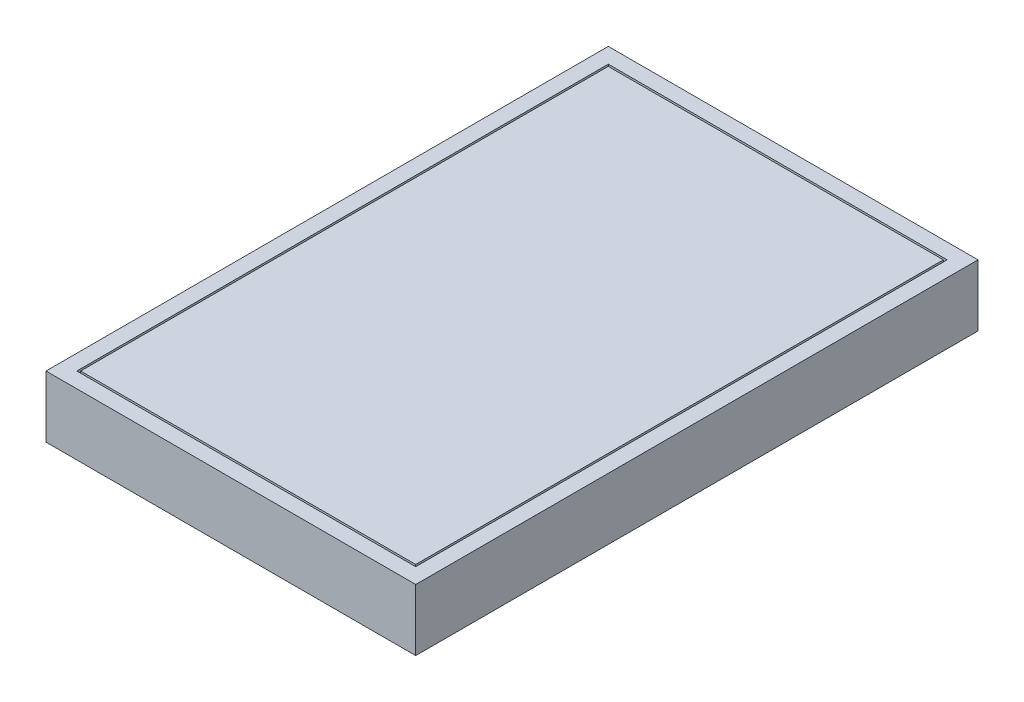
ISO-10303-21;
HEADER;
FILE_DESCRIPTION(('STEP AP214'),'2;1');
FILE_NAME('part.step','',(''),(''),'','','');
FILE_SCHEMA(('AUTOMOTIVE_DESIGN { 1 0 10303 214 1 1 1 1 }'));
ENDSEC;
DATA;
#1=APPLICATION_CONTEXT('core data for automotive mechanical design processes');
#2=APPLICATION_PROTOCOL_DEFINITION('international standard','automotive_design',2000,#1);
#3=PRODUCT_CONTEXT('',#1,'mechanical');
#4=PRODUCT('Part','Part','',(#3));
#5=PRODUCT_RELATED_PRODUCT_CATEGORY('part','',(#4));
#6=PRODUCT_DEFINITION_FORMATION('','',#4);
#7=PRODUCT_DEFINITION_CONTEXT('part definition',#1,'design');
#8=PRODUCT_DEFINITION('design','',#6,#7);
#9=PRODUCT_DEFINITION_SHAPE('','',#8);
#10=(LENGTH_UNIT() NAMED_UNIT(*) SI_UNIT(.MILLI.,.METRE.));
#11=(NAMED_UNIT(*) PLANE_ANGLE_UNIT() SI_UNIT($,.RADIAN.));
#12=(NAMED_UNIT(*) SI_UNIT($,.STERADIAN.) SOLID_ANGLE_UNIT());
#13=UNCERTAINTY_MEASURE_WITH_UNIT(LENGTH_MEASURE(1.E-05),#10,'distance_accuracy_value','');
#14=(GEOMETRIC_REPRESENTATION_CONTEXT(3) GLOBAL_UNCERTAINTY_ASSIGNED_CONTEXT((#13)) GLOBAL_UNIT_ASSIGNED_CONTEXT((#10,
#11,#12)) REPRESENTATION_CONTEXT('',''));
#15=CARTESIAN_POINT('',(0.,0.,0.));
#16=DIRECTION('',(0.,0.,1.));
#17=DIRECTION('',(1.,0.,0.));
#18=AXIS2_PLACEMENT_3D('',#15,#16,#17);
#19=CARTESIAN_POINT('',(0.,8.99999999999999,0.));
#20=DIRECTION('',(0.,1.,0.));
#21=DIRECTION('',(0.,0.,1.));
#22=AXIS2_PLACEMENT_3D('',#19,#20,#21);
#23=PLANE('',#22);
#24=DIRECTION('',(0.,0.,1.));
#25=VECTOR('',#24,1.);
#26=CARTESIAN_POINT('',(-220.,8.99999999999999,20.));
#27=LINE('',#26,#25);
#28=CARTESIAN_POINT('',(-220.,8.99999999999999,20.));
#29=VERTEX_POINT('',#28);
#30=CARTESIAN_POINT('',(-220.,8.99999999999999,710.));
#31=VERTEX_POINT('',#30);
#32=EDGE_CURVE('E155',#29,#31,#27,.T.);
#33=ORIENTED_EDGE('',*,*,#32,.T.);
#34=DIRECTION('',(1.,0.,0.));
#35=VECTOR('',#34,1.);
#36=CARTESIAN_POINT('',(-220.,8.99999999999999,710.));
#37=LINE('',#36,#35);
#38=CARTESIAN_POINT('',(220.,8.99999999999999,710.));
#39=VERTEX_POINT('',#38);
#40=EDGE_CURVE('E158',#31,#39,#37,.T.);
#41=ORIENTED_EDGE('',*,*,#40,.T.);
#42=DIRECTION('',(0.,0.,-1.));
#43=VECTOR('',#42,1.);
#44=CARTESIAN_POINT('',(220.,8.99999999999999,710.));
#45=LINE('',#44,#43);
#46=CARTESIAN_POINT('',(220.,8.99999999999999,20.));
#47=VERTEX_POINT('',#46);
#48=EDGE_CURVE('E162',#39,#47,#45,.T.);
#49=ORIENTED_EDGE('',*,*,#48,.T.);
#50=DIRECTION('',(-1.,0.,0.));
#51=VECTOR('',#50,1.);
#52=CARTESIAN_POINT('',(220.,8.99999999999999,20.));
#53=LINE('',#52,#51);
#54=EDGE_CURVE('E165',#47,#29,#53,.T.);
#55=ORIENTED_EDGE('',*,*,#54,.T.);
#56=EDGE_LOOP('',(#33,#41,#49,#55));
#57=FACE_BOUND('',#56,.T.);
#58=DIRECTION('',(0.,0.,-1.));
#59=VECTOR('',#58,1.);
#60=CARTESIAN_POINT('',(217.5,8.99999999999999,22.5));
#61=LINE('',#60,#59);
#62=CARTESIAN_POINT('',(217.5,8.99999999999999,707.5));
#63=VERTEX_POINT('',#62);
#64=CARTESIAN_POINT('',(217.5,8.99999999999999,22.5));
#65=VERTEX_POINT('',#64);
#66=EDGE_CURVE('E372',#63,#65,#61,.T.);
#67=ORIENTED_EDGE('',*,*,#66,.F.);
#68=DIRECTION('',(1.,0.,0.));
#69=VECTOR('',#68,1.);
#70=CARTESIAN_POINT('',(217.5,8.99999999999999,707.5));
#71=LINE('',#70,#69);
#72=CARTESIAN_POINT('',(-217.5,8.99999999999999,707.5));
#73=VERTEX_POINT('',#72);
#74=EDGE_CURVE('E147',#73,#63,#71,.T.);
#75=ORIENTED_EDGE('',*,*,#74,.F.);
#76=DIRECTION('',(0.,0.,1.));
#77=VECTOR('',#76,1.);
#78=CARTESIAN_POINT('',(-217.5,8.99999999999999,707.5));
#79=LINE('',#78,#77);
#80=CARTESIAN_POINT('',(-217.5,8.99999999999999,22.5));
#81=VERTEX_POINT('',#80);
#82=EDGE_CURVE('E143',#81,#73,#79,.T.);
#83=ORIENTED_EDGE('',*,*,#82,.F.);
#84=DIRECTION('',(-1.,0.,0.));
#85=VECTOR('',#84,1.);
#86=CARTESIAN_POINT('',(-217.5,8.99999999999999,22.5));
#87=LINE('',#86,#85);
#88=EDGE_CURVE('E369',#65,#81,#87,.T.);
#89=ORIENTED_EDGE('',*,*,#88,.F.);
#90=EDGE_LOOP('',(#67,#75,#83,#89));
#91=FACE_BOUND('',#90,.T.);
#92=ADVANCED_FACE('F34',(#57,#91),#23,.T.);
#93=CARTESIAN_POINT('',(-240.,20.,730.));
#94=DIRECTION('',(-1.,0.,0.));
#95=DIRECTION('',(0.,0.,1.));
#96=AXIS2_PLACEMENT_3D('',#93,#94,#95);
#97=PLANE('',#96);
#98=DIRECTION('',(0.,0.,-1.));
#99=VECTOR('',#98,1.);
#100=CARTESIAN_POINT('',(-240.,-60.,730.));
#101=LINE('',#100,#99);
#102=CARTESIAN_POINT('',(-240.,-60.,730.));
#103=VERTEX_POINT('',#102);
#104=CARTESIAN_POINT('',(-240.,-60.,0.));
#105=VERTEX_POINT('',#104);
#106=EDGE_CURVE('E178',#103,#105,#101,.T.);
#107=ORIENTED_EDGE('',*,*,#106,.F.);
#108=DIRECTION('',(0.,-1.,0.));
#109=VECTOR('',#108,1.);
#110=CARTESIAN_POINT('',(-240.,20.,730.));
#111=LINE('',#110,#109);
#112=CARTESIAN_POINT('',(-240.,20.,730.));
#113=VERTEX_POINT('',#112);
#114=EDGE_CURVE('E11',#113,#103,#111,.T.);
#115=ORIENTED_EDGE('',*,*,#114,.F.);
#116=DIRECTION('',(0.,0.,-1.));
#117=VECTOR('',#116,1.);
#118=CARTESIAN_POINT('',(-240.,20.,730.));
#119=LINE('',#118,#117);
#120=CARTESIAN_POINT('',(-240.,20.,0.));
#121=VERTEX_POINT('',#120);
#122=EDGE_CURVE('E184',#113,#121,#119,.T.);
#123=ORIENTED_EDGE('',*,*,#122,.T.);
#124=DIRECTION('',(0.,-1.,0.));
#125=VECTOR('',#124,1.);
#126=CARTESIAN_POINT('',(-240.,20.,0.));
#127=LINE('',#126,#125);
#128=EDGE_CURVE('E38',#121,#105,#127,.T.);
#129=ORIENTED_EDGE('',*,*,#128,.T.);
#130=EDGE_LOOP('',(#107,#115,#123,#129));
#131=FACE_BOUND('',#130,.T.);
#132=ADVANCED_FACE('F36',(#131),#97,.T.);
#133=CARTESIAN_POINT('',(240.,20.,730.));
#134=DIRECTION('',(0.,0.,1.));
#135=DIRECTION('',(1.,0.,0.));
#136=AXIS2_PLACEMENT_3D('',#133,#134,#135);
#137=PLANE('',#136);
#138=DIRECTION('',(-1.,0.,0.));
#139=VECTOR('',#138,1.);
#140=CARTESIAN_POINT('',(240.,-60.,730.));
#141=LINE('',#140,#139);
#142=CARTESIAN_POINT('',(240.,-60.,730.));
#143=VERTEX_POINT('',#142);
#144=EDGE_CURVE('E188',#143,#103,#141,.T.);
#145=ORIENTED_EDGE('',*,*,#144,.F.);
#146=DIRECTION('',(0.,-1.,0.));
#147=VECTOR('',#146,1.);
#148=CARTESIAN_POINT('',(240.,20.,730.));
#149=LINE('',#148,#147);
#150=CARTESIAN_POINT('',(240.,20.,730.));
#151=VERTEX_POINT('',#150);
#152=EDGE_CURVE('E43',#151,#143,#149,.T.);
#153=ORIENTED_EDGE('',*,*,#152,.F.);
#154=DIRECTION('',(-1.,0.,0.));
#155=VECTOR('',#154,1.);
#156=CARTESIAN_POINT('',(240.,20.,730.));
#157=LINE('',#156,#155);
#158=EDGE_CURVE('E194',#151,#113,#157,.T.);
#159=ORIENTED_EDGE('',*,*,#158,.T.);
#160=ORIENTED_EDGE('',*,*,#114,.T.);
#161=EDGE_LOOP('',(#145,#153,#159,#160));
#162=FACE_BOUND('',#161,.T.);
#163=ADVANCED_FACE('F220',(#162),#137,.T.);
#164=CARTESIAN_POINT('',(240.,20.,0.));
#165=DIRECTION('',(1.,0.,0.));
#166=DIRECTION('',(0.,0.,-1.));
#167=AXIS2_PLACEMENT_3D('',#164,#165,#166);
#168=PLANE('',#167);
#169=DIRECTION('',(0.,0.,1.));
#170=VECTOR('',#169,1.);
#171=CARTESIAN_POINT('',(240.,-60.,0.));
#172=LINE('',#171,#170);
#173=CARTESIAN_POINT('',(240.,-60.,0.));
#174=VERTEX_POINT('',#173);
#175=EDGE_CURVE('E202',#174,#143,#172,.T.);
#176=ORIENTED_EDGE('',*,*,#175,.F.);
#177=DIRECTION('',(0.,-1.,0.));
#178=VECTOR('',#177,1.);
#179=CARTESIAN_POINT('',(240.,20.,0.));
#180=LINE('',#179,#178);
#181=CARTESIAN_POINT('',(240.,20.,0.));
#182=VERTEX_POINT('',#181);
#183=EDGE_CURVE('E207',#182,#174,#180,.T.);
#184=ORIENTED_EDGE('',*,*,#183,.F.);
#185=DIRECTION('',(0.,0.,1.));
#186=VECTOR('',#185,1.);
#187=CARTESIAN_POINT('',(240.,20.,0.));
#188=LINE('',#187,#186);
#189=EDGE_CURVE('E191',#182,#151,#188,.T.);
#190=ORIENTED_EDGE('',*,*,#189,.T.);
#191=ORIENTED_EDGE('',*,*,#152,.T.);
#192=EDGE_LOOP('',(#176,#184,#190,#191));
#193=FACE_BOUND('',#192,.T.);
#194=ADVANCED_FACE('F226',(#193),#168,.T.);
#195=CARTESIAN_POINT('',(-240.,20.,0.));
#196=DIRECTION('',(0.,0.,-1.));
#197=DIRECTION('',(-1.,0.,0.));
#198=AXIS2_PLACEMENT_3D('',#195,#196,#197);
#199=PLANE('',#198);
#200=DIRECTION('',(1.,0.,0.));
#201=VECTOR('',#200,1.);
#202=CARTESIAN_POINT('',(-240.,-60.,0.));
#203=LINE('',#202,#201);
#204=EDGE_CURVE('E199',#105,#174,#203,.T.);
#205=ORIENTED_EDGE('',*,*,#204,.F.);
#206=ORIENTED_EDGE('',*,*,#128,.F.);
#207=DIRECTION('',(1.,0.,0.));
#208=VECTOR('',#207,1.);
#209=CARTESIAN_POINT('',(-240.,20.,0.));
#210=LINE('',#209,#208);
#211=EDGE_CURVE('E187',#121,#182,#210,.T.);
#212=ORIENTED_EDGE('',*,*,#211,.T.);
#213=ORIENTED_EDGE('',*,*,#183,.T.);
#214=EDGE_LOOP('',(#205,#206,#212,#213));
#215=FACE_BOUND('',#214,.T.);
#216=ADVANCED_FACE('F215',(#215),#199,.T.);
#217=CARTESIAN_POINT('',(0.,20.,0.));
#218=DIRECTION('',(0.,-1.,0.));
#219=DIRECTION('',(0.,0.,-1.));
#220=AXIS2_PLACEMENT_3D('',#217,#218,#219);
#221=PLANE('',#220);
#222=DIRECTION('',(1.,0.,0.));
#223=VECTOR('',#222,1.);
#224=CARTESIAN_POINT('',(-220.,20.,710.));
#225=LINE('',#224,#223);
#226=CARTESIAN_POINT('',(-220.,20.,710.));
#227=VERTEX_POINT('',#226);
#228=CARTESIAN_POINT('',(220.,20.,710.));
#229=VERTEX_POINT('',#228);
#230=EDGE_CURVE('E150',#227,#229,#225,.T.);
#231=ORIENTED_EDGE('',*,*,#230,.F.);
#232=DIRECTION('',(0.,0.,1.));
#233=VECTOR('',#232,1.);
#234=CARTESIAN_POINT('',(-220.,20.,20.));
#235=LINE('',#234,#233);
#236=CARTESIAN_POINT('',(-220.,20.,20.));
#237=VERTEX_POINT('',#236);
#238=EDGE_CURVE('E59',#237,#227,#235,.T.);
#239=ORIENTED_EDGE('',*,*,#238,.F.);
#240=DIRECTION('',(-1.,0.,0.));
#241=VECTOR('',#240,1.);
#242=CARTESIAN_POINT('',(220.,20.,20.));
#243=LINE('',#242,#241);
#244=CARTESIAN_POINT('',(220.,20.,20.));
#245=VERTEX_POINT('',#244);
#246=EDGE_CURVE('E159',#245,#237,#243,.T.);
#247=ORIENTED_EDGE('',*,*,#246,.F.);
#248=DIRECTION('',(0.,0.,-1.));
#249=VECTOR('',#248,1.);
#250=CARTESIAN_POINT('',(220.,20.,710.));
#251=LINE('',#250,#249);
#252=EDGE_CURVE('E171',#229,#245,#251,.T.);
#253=ORIENTED_EDGE('',*,*,#252,.F.);
#254=EDGE_LOOP('',(#231,#239,#247,#253));
#255=FACE_BOUND('',#254,.T.);
#256=ORIENTED_EDGE('',*,*,#122,.F.);
#257=ORIENTED_EDGE('',*,*,#158,.F.);
#258=ORIENTED_EDGE('',*,*,#189,.F.);
#259=ORIENTED_EDGE('',*,*,#211,.F.);
#260=EDGE_LOOP('',(#256,#257,#258,#259));
#261=FACE_BOUND('',#260,.T.);
#262=ADVANCED_FACE('F223',(#255,#261),#221,.F.);
#263=CARTESIAN_POINT('',(0.,-60.,0.));
#264=DIRECTION('',(0.,-1.,0.));
#265=DIRECTION('',(0.,0.,-1.));
#266=AXIS2_PLACEMENT_3D('',#263,#264,#265);
#267=PLANE('',#266);
#268=ORIENTED_EDGE('',*,*,#106,.T.);
#269=ORIENTED_EDGE('',*,*,#204,.T.);
#270=ORIENTED_EDGE('',*,*,#175,.T.);
#271=ORIENTED_EDGE('',*,*,#144,.T.);
#272=EDGE_LOOP('',(#268,#269,#270,#271));
#273=FACE_BOUND('',#272,.T.);
#274=ADVANCED_FACE('F217',(#273),#267,.T.);
#275=CARTESIAN_POINT('',(-220.,8.99999999999999,20.));
#276=DIRECTION('',(-1.,0.,0.));
#277=DIRECTION('',(0.,0.,1.));
#278=AXIS2_PLACEMENT_3D('',#275,#276,#277);
#279=PLANE('',#278);
#280=ORIENTED_EDGE('',*,*,#238,.T.);
#281=DIRECTION('',(0.,1.,0.));
#282=VECTOR('',#281,1.);
#283=CARTESIAN_POINT('',(-220.,8.99999999999999,710.));
#284=LINE('',#283,#282);
#285=EDGE_CURVE('E167',#31,#227,#284,.T.);
#286=ORIENTED_EDGE('',*,*,#285,.F.);
#287=ORIENTED_EDGE('',*,*,#32,.F.);
#288=DIRECTION('',(0.,1.,0.));
#289=VECTOR('',#288,1.);
#290=CARTESIAN_POINT('',(-220.,8.99999999999999,20.));
#291=LINE('',#290,#289);
#292=EDGE_CURVE('E176',#29,#237,#291,.T.);
#293=ORIENTED_EDGE('',*,*,#292,.T.);
#294=EDGE_LOOP('',(#280,#286,#287,#293));
#295=FACE_BOUND('',#294,.T.);
#296=ADVANCED_FACE('F248',(#295),#279,.F.);
#297=CARTESIAN_POINT('',(220.,8.99999999999999,20.));
#298=DIRECTION('',(0.,0.,-1.));
#299=DIRECTION('',(-1.,0.,0.));
#300=AXIS2_PLACEMENT_3D('',#297,#298,#299);
#301=PLANE('',#300);
#302=ORIENTED_EDGE('',*,*,#246,.T.);
#303=ORIENTED_EDGE('',*,*,#292,.F.);
#304=ORIENTED_EDGE('',*,*,#54,.F.);
#305=DIRECTION('',(0.,1.,0.));
#306=VECTOR('',#305,1.);
#307=CARTESIAN_POINT('',(220.,8.99999999999999,20.));
#308=LINE('',#307,#306);
#309=EDGE_CURVE('E179',#47,#245,#308,.T.);
#310=ORIENTED_EDGE('',*,*,#309,.T.);
#311=EDGE_LOOP('',(#302,#303,#304,#310));
#312=FACE_BOUND('',#311,.T.);
#313=ADVANCED_FACE('F244',(#312),#301,.F.);
#314=CARTESIAN_POINT('',(220.,8.99999999999999,710.));
#315=DIRECTION('',(1.,0.,0.));
#316=DIRECTION('',(0.,0.,-1.));
#317=AXIS2_PLACEMENT_3D('',#314,#315,#316);
#318=PLANE('',#317);
#319=ORIENTED_EDGE('',*,*,#252,.T.);
#320=ORIENTED_EDGE('',*,*,#309,.F.);
#321=ORIENTED_EDGE('',*,*,#48,.F.);
#322=DIRECTION('',(0.,1.,0.));
#323=VECTOR('',#322,1.);
#324=CARTESIAN_POINT('',(220.,8.99999999999999,710.));
#325=LINE('',#324,#323);
#326=EDGE_CURVE('E181',#39,#229,#325,.T.);
#327=ORIENTED_EDGE('',*,*,#326,.T.);
#328=EDGE_LOOP('',(#319,#320,#321,#327));
#329=FACE_BOUND('',#328,.T.);
#330=ADVANCED_FACE('F247',(#329),#318,.F.);
#331=CARTESIAN_POINT('',(-220.,8.99999999999999,710.));
#332=DIRECTION('',(0.,0.,1.));
#333=DIRECTION('',(1.,0.,0.));
#334=AXIS2_PLACEMENT_3D('',#331,#332,#333);
#335=PLANE('',#334);
#336=ORIENTED_EDGE('',*,*,#230,.T.);
#337=ORIENTED_EDGE('',*,*,#326,.F.);
#338=ORIENTED_EDGE('',*,*,#40,.F.);
#339=ORIENTED_EDGE('',*,*,#285,.T.);
#340=EDGE_LOOP('',(#336,#337,#338,#339));
#341=FACE_BOUND('',#340,.T.);
#342=ADVANCED_FACE('F252',(#341),#335,.F.);
#343=CARTESIAN_POINT('',(217.5,20.,707.5));
#344=DIRECTION('',(0.,0.,-1.));
#345=DIRECTION('',(-1.,0.,0.));
#346=AXIS2_PLACEMENT_3D('',#343,#344,#345);
#347=PLANE('',#346);
#348=ORIENTED_EDGE('',*,*,#74,.T.);
#349=DIRECTION('',(0.,-1.,0.));
#350=VECTOR('',#349,1.);
#351=CARTESIAN_POINT('',(217.5,20.,707.5));
#352=LINE('',#351,#350);
#353=CARTESIAN_POINT('',(217.5,20.,707.5));
#354=VERTEX_POINT('',#353);
#355=EDGE_CURVE('E128',#354,#63,#352,.T.);
#356=ORIENTED_EDGE('',*,*,#355,.F.);
#357=DIRECTION('',(1.,0.,0.));
#358=VECTOR('',#357,1.);
#359=CARTESIAN_POINT('',(217.5,20.,707.5));
#360=LINE('',#359,#358);
#361=CARTESIAN_POINT('',(-217.5,20.,707.5));
#362=VERTEX_POINT('',#361);
#363=EDGE_CURVE('E135',#362,#354,#360,.T.);
#364=ORIENTED_EDGE('',*,*,#363,.F.);
#365=DIRECTION('',(0.,-1.,0.));
#366=VECTOR('',#365,1.);
#367=CARTESIAN_POINT('',(-217.5,20.,707.5));
#368=LINE('',#367,#366);
#369=EDGE_CURVE('E367',#362,#73,#368,.T.);
#370=ORIENTED_EDGE('',*,*,#369,.T.);
#371=EDGE_LOOP('',(#348,#356,#364,#370));
#372=FACE_BOUND('',#371,.T.);
#373=ADVANCED_FACE('F145',(#372),#347,.F.);
#374=CARTESIAN_POINT('',(217.5,20.,22.5));
#375=DIRECTION('',(-1.,0.,0.));
#376=DIRECTION('',(0.,0.,1.));
#377=AXIS2_PLACEMENT_3D('',#374,#375,#376);
#378=PLANE('',#377);
#379=ORIENTED_EDGE('',*,*,#66,.T.);
#380=DIRECTION('',(0.,-1.,0.));
#381=VECTOR('',#380,1.);
#382=CARTESIAN_POINT('',(217.5,20.,22.5));
#383=LINE('',#382,#381);
#384=CARTESIAN_POINT('',(217.5,20.,22.5));
#385=VERTEX_POINT('',#384);
#386=EDGE_CURVE('E131',#385,#65,#383,.T.);
#387=ORIENTED_EDGE('',*,*,#386,.F.);
#388=DIRECTION('',(0.,0.,-1.));
#389=VECTOR('',#388,1.);
#390=CARTESIAN_POINT('',(217.5,20.,22.5));
#391=LINE('',#390,#389);
#392=EDGE_CURVE('E124',#354,#385,#391,.T.);
#393=ORIENTED_EDGE('',*,*,#392,.F.);
#394=ORIENTED_EDGE('',*,*,#355,.T.);
#395=EDGE_LOOP('',(#379,#387,#393,#394));
#396=FACE_BOUND('',#395,.T.);
#397=ADVANCED_FACE('F126',(#396),#378,.F.);
#398=CARTESIAN_POINT('',(-217.5,20.,22.5));
#399=DIRECTION('',(0.,0.,1.));
#400=DIRECTION('',(1.,0.,0.));
#401=AXIS2_PLACEMENT_3D('',#398,#399,#400);
#402=PLANE('',#401);
#403=ORIENTED_EDGE('',*,*,#88,.T.);
#404=DIRECTION('',(0.,-1.,0.));
#405=VECTOR('',#404,1.);
#406=CARTESIAN_POINT('',(-217.5,20.,22.5));
#407=LINE('',#406,#405);
#408=CARTESIAN_POINT('',(-217.5,20.,22.5));
#409=VERTEX_POINT('',#408);
#410=EDGE_CURVE('E51',#409,#81,#407,.T.);
#411=ORIENTED_EDGE('',*,*,#410,.F.);
#412=DIRECTION('',(-1.,0.,0.));
#413=VECTOR('',#412,1.);
#414=CARTESIAN_POINT('',(-217.5,20.,22.5));
#415=LINE('',#414,#413);
#416=EDGE_CURVE('E134',#385,#409,#415,.T.);
#417=ORIENTED_EDGE('',*,*,#416,.F.);
#418=ORIENTED_EDGE('',*,*,#386,.T.);
#419=EDGE_LOOP('',(#403,#411,#417,#418));
#420=FACE_BOUND('',#419,.T.);
#421=ADVANCED_FACE('F295',(#420),#402,.F.);
#422=CARTESIAN_POINT('',(-217.5,20.,707.5));
#423=DIRECTION('',(1.,0.,0.));
#424=DIRECTION('',(0.,0.,-1.));
#425=AXIS2_PLACEMENT_3D('',#422,#423,#424);
#426=PLANE('',#425);
#427=ORIENTED_EDGE('',*,*,#82,.T.);
#428=ORIENTED_EDGE('',*,*,#369,.F.);
#429=DIRECTION('',(0.,0.,1.));
#430=VECTOR('',#429,1.);
#431=CARTESIAN_POINT('',(-217.5,20.,707.5));
#432=LINE('',#431,#430);
#433=EDGE_CURVE('E139',#409,#362,#432,.T.);
#434=ORIENTED_EDGE('',*,*,#433,.F.);
#435=ORIENTED_EDGE('',*,*,#410,.T.);
#436=EDGE_LOOP('',(#427,#428,#434,#435));
#437=FACE_BOUND('',#436,.T.);
#438=ADVANCED_FACE('F301',(#437),#426,.F.);
#439=CARTESIAN_POINT('',(0.,20.,0.));
#440=DIRECTION('',(0.,-1.,0.));
#441=DIRECTION('',(0.,0.,-1.));
#442=AXIS2_PLACEMENT_3D('',#439,#440,#441);
#443=PLANE('',#442);
#444=ORIENTED_EDGE('',*,*,#363,.T.);
#445=ORIENTED_EDGE('',*,*,#392,.T.);
#446=ORIENTED_EDGE('',*,*,#416,.T.);
#447=ORIENTED_EDGE('',*,*,#433,.T.);
#448=EDGE_LOOP('',(#444,#445,#446,#447));
#449=FACE_BOUND('',#448,.T.);
#450=ADVANCED_FACE('F138',(#449),#443,.F.);
#451=CLOSED_SHELL('',(#92,#132,#163,#194,#216,#262,#274,#296,#313,#330,#342,#373,#397,#421,#438,#450));
#452=MANIFOLD_SOLID_BREP('B2',#451);
#453=ADVANCED_BREP_SHAPE_REPRESENTATION('',(#18,#452),#14);
#454=SHAPE_DEFINITION_REPRESENTATION(#9,#453);
ENDSEC;
END-ISO-10303-21;
